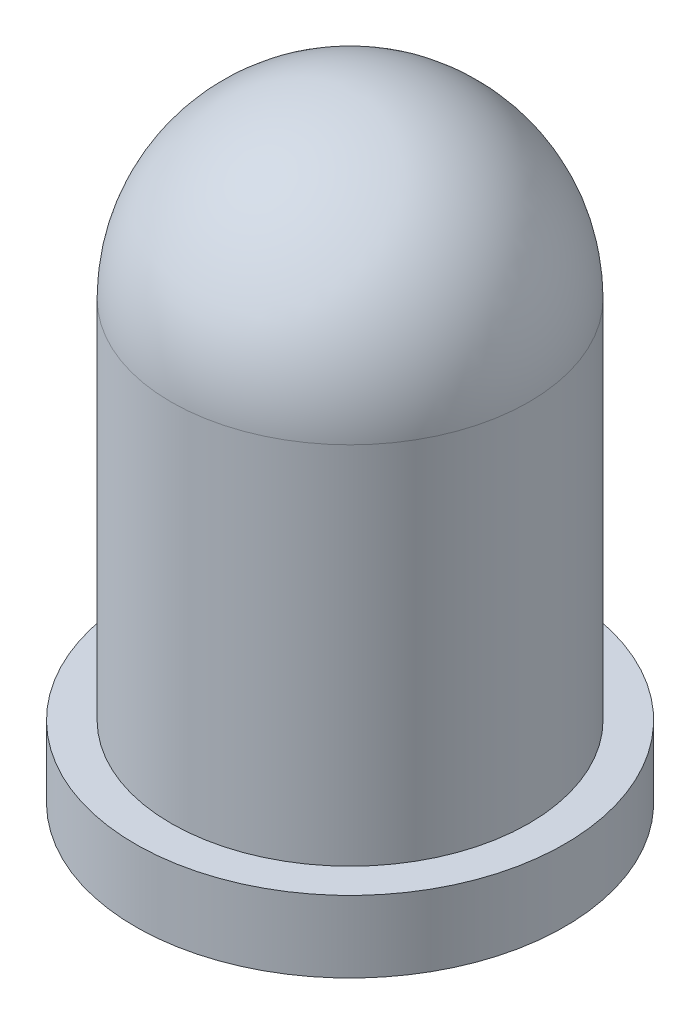
ISO-10303-21;
HEADER;
FILE_DESCRIPTION(('STEP AP214'),'2;1');
FILE_NAME('part.step','',(''),(''),'','','');
FILE_SCHEMA(('AUTOMOTIVE_DESIGN { 1 0 10303 214 1 1 1 1 }'));
ENDSEC;
DATA;
#1=APPLICATION_CONTEXT('core data for automotive mechanical design processes');
#2=APPLICATION_PROTOCOL_DEFINITION('international standard','automotive_design',2000,#1);
#3=PRODUCT_CONTEXT('',#1,'mechanical');
#4=PRODUCT('Part','Part','',(#3));
#5=PRODUCT_RELATED_PRODUCT_CATEGORY('part','',(#4));
#6=PRODUCT_DEFINITION_FORMATION('','',#4);
#7=PRODUCT_DEFINITION_CONTEXT('part definition',#1,'design');
#8=PRODUCT_DEFINITION('design','',#6,#7);
#9=PRODUCT_DEFINITION_SHAPE('','',#8);
#10=(LENGTH_UNIT() NAMED_UNIT(*) SI_UNIT(.MILLI.,.METRE.));
#11=(NAMED_UNIT(*) PLANE_ANGLE_UNIT() SI_UNIT($,.RADIAN.));
#12=(NAMED_UNIT(*) SI_UNIT($,.STERADIAN.) SOLID_ANGLE_UNIT());
#13=UNCERTAINTY_MEASURE_WITH_UNIT(LENGTH_MEASURE(1.E-05),#10,'distance_accuracy_value','');
#14=(GEOMETRIC_REPRESENTATION_CONTEXT(3) GLOBAL_UNCERTAINTY_ASSIGNED_CONTEXT((#13)) GLOBAL_UNIT_ASSIGNED_CONTEXT((#10,
#11,#12)) REPRESENTATION_CONTEXT('',''));
#15=CARTESIAN_POINT('',(0.,0.,0.));
#16=DIRECTION('',(0.,0.,1.));
#17=DIRECTION('',(1.,0.,0.));
#18=AXIS2_PLACEMENT_3D('',#15,#16,#17);
#19=CARTESIAN_POINT('',(0.,0.,0.));
#20=DIRECTION('',(0.,-1.,0.));
#21=DIRECTION('',(1.,0.,0.));
#22=AXIS2_PLACEMENT_3D('',#19,#20,#21);
#23=PLANE('',#22);
#24=CARTESIAN_POINT('',(0.,0.,0.));
#25=DIRECTION('',(0.,1.,0.));
#26=DIRECTION('',(-1.,0.,0.));
#27=AXIS2_PLACEMENT_3D('',#24,#25,#26);
#28=CIRCLE('',#27,3.);
#29=CARTESIAN_POINT('',(-3.,0.,0.));
#30=VERTEX_POINT('',#29);
#31=EDGE_CURVE('E45',#30,#30,#28,.T.);
#32=ORIENTED_EDGE('',*,*,#31,.F.);
#33=EDGE_LOOP('',(#32));
#34=FACE_BOUND('',#33,.T.);
#35=ADVANCED_FACE('F31',(#34),#23,.T.);
#36=CARTESIAN_POINT('',(0.,6.1,0.));
#37=DIRECTION('',(0.,1.,0.));
#38=DIRECTION('',(1.,0.,0.));
#39=AXIS2_PLACEMENT_3D('',#36,#37,#38);
#40=SPHERICAL_SURFACE('',#39,2.5);
#41=CARTESIAN_POINT('',(0.,6.1,0.));
#42=DIRECTION('',(0.,1.,0.));
#43=DIRECTION('',(-1.,0.,0.));
#44=AXIS2_PLACEMENT_3D('',#41,#42,#43);
#45=CIRCLE('',#44,2.5);
#46=CARTESIAN_POINT('',(-2.5,6.1,0.));
#47=VERTEX_POINT('',#46);
#48=EDGE_CURVE('E10',#47,#47,#45,.T.);
#49=ORIENTED_EDGE('',*,*,#48,.T.);
#50=EDGE_LOOP('',(#49));
#51=FACE_BOUND('',#50,.T.);
#52=ADVANCED_FACE('F55',(#51),#40,.T.);
#53=CARTESIAN_POINT('',(0.,6.1,0.));
#54=DIRECTION('',(0.,1.,0.));
#55=DIRECTION('',(-1.,0.,0.));
#56=AXIS2_PLACEMENT_3D('',#53,#54,#55);
#57=CYLINDRICAL_SURFACE('',#56,2.5);
#58=CARTESIAN_POINT('',(0.,0.999999999999999,0.));
#59=DIRECTION('',(0.,1.,0.));
#60=DIRECTION('',(-1.,0.,0.));
#61=AXIS2_PLACEMENT_3D('',#58,#59,#60);
#62=CIRCLE('',#61,2.5);
#63=CARTESIAN_POINT('',(-2.5,0.999999999999999,0.));
#64=VERTEX_POINT('',#63);
#65=EDGE_CURVE('E37',#64,#64,#62,.T.);
#66=ORIENTED_EDGE('',*,*,#65,.T.);
#67=EDGE_LOOP('',(#66));
#68=FACE_BOUND('',#67,.T.);
#69=ORIENTED_EDGE('',*,*,#48,.F.);
#70=EDGE_LOOP('',(#69));
#71=FACE_BOUND('',#70,.T.);
#72=ADVANCED_FACE('F59',(#68,#71),#57,.T.);
#73=CARTESIAN_POINT('',(-3.,1.,0.));
#74=DIRECTION('',(0.,1.,0.));
#75=DIRECTION('',(-1.,0.,0.));
#76=AXIS2_PLACEMENT_3D('',#73,#74,#75);
#77=PLANE('',#76);
#78=CARTESIAN_POINT('',(0.,0.999999999999999,0.));
#79=DIRECTION('',(0.,1.,0.));
#80=DIRECTION('',(-1.,0.,0.));
#81=AXIS2_PLACEMENT_3D('',#78,#79,#80);
#82=CIRCLE('',#81,3.);
#83=CARTESIAN_POINT('',(-3.,0.999999999999999,0.));
#84=VERTEX_POINT('',#83);
#85=EDGE_CURVE('E41',#84,#84,#82,.T.);
#86=ORIENTED_EDGE('',*,*,#85,.T.);
#87=EDGE_LOOP('',(#86));
#88=FACE_BOUND('',#87,.T.);
#89=ORIENTED_EDGE('',*,*,#65,.F.);
#90=EDGE_LOOP('',(#89));
#91=FACE_BOUND('',#90,.T.);
#92=ADVANCED_FACE('F63',(#88,#91),#77,.T.);
#93=CARTESIAN_POINT('',(0.,6.1,0.));
#94=DIRECTION('',(0.,1.,0.));
#95=DIRECTION('',(-1.,0.,0.));
#96=AXIS2_PLACEMENT_3D('',#93,#94,#95);
#97=CYLINDRICAL_SURFACE('',#96,3.);
#98=ORIENTED_EDGE('',*,*,#31,.T.);
#99=EDGE_LOOP('',(#98));
#100=FACE_BOUND('',#99,.T.);
#101=ORIENTED_EDGE('',*,*,#85,.F.);
#102=EDGE_LOOP('',(#101));
#103=FACE_BOUND('',#102,.T.);
#104=ADVANCED_FACE('F51',(#100,#103),#97,.T.);
#105=CLOSED_SHELL('',(#35,#52,#72,#92,#104));
#106=MANIFOLD_SOLID_BREP('B2',#105);
#107=ADVANCED_BREP_SHAPE_REPRESENTATION('',(#18,#106),#14);
#108=SHAPE_DEFINITION_REPRESENTATION(#9,#107);
ENDSEC;
END-ISO-10303-21;
